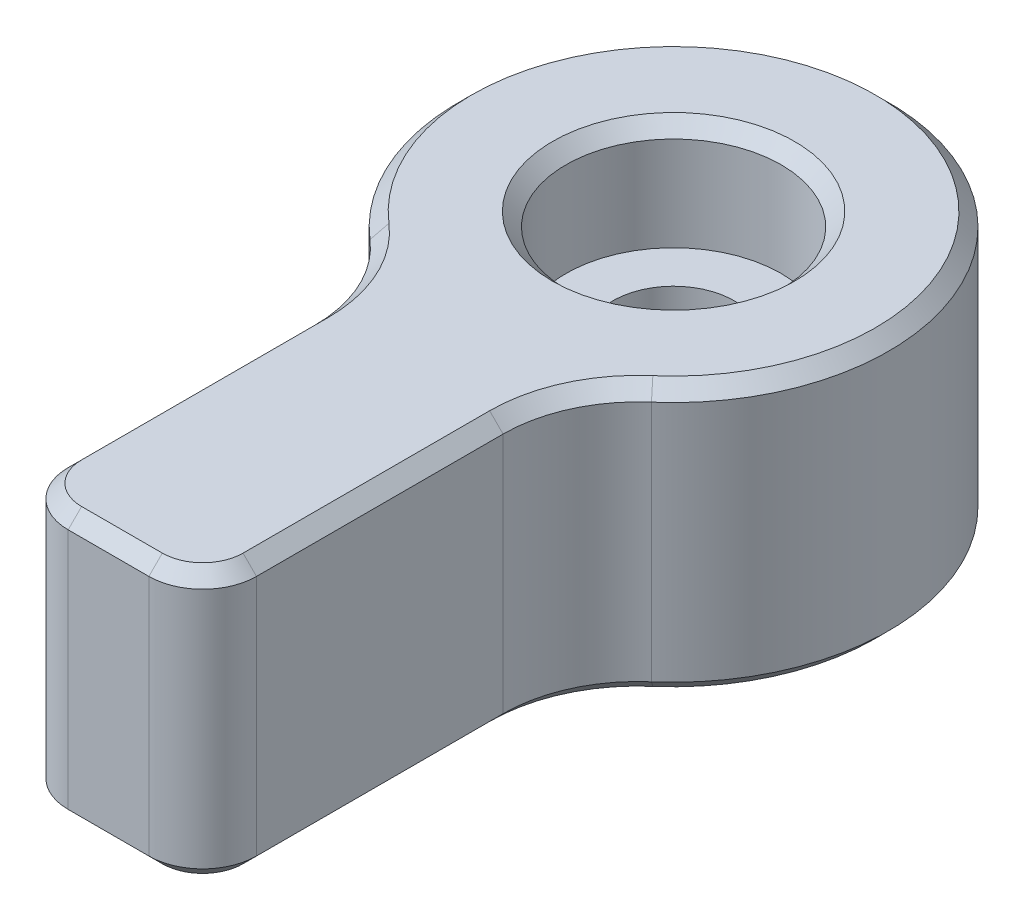
ISO-10303-21;
HEADER;
FILE_DESCRIPTION(('STEP AP214'),'2;1');
FILE_NAME('part.step','',(''),(''),'','','');
FILE_SCHEMA(('AUTOMOTIVE_DESIGN { 1 0 10303 214 1 1 1 1 }'));
ENDSEC;
DATA;
#1=APPLICATION_CONTEXT('core data for automotive mechanical design processes');
#2=APPLICATION_PROTOCOL_DEFINITION('international standard','automotive_design',2000,#1);
#3=PRODUCT_CONTEXT('',#1,'mechanical');
#4=PRODUCT('Part','Part','',(#3));
#5=PRODUCT_RELATED_PRODUCT_CATEGORY('part','',(#4));
#6=PRODUCT_DEFINITION_FORMATION('','',#4);
#7=PRODUCT_DEFINITION_CONTEXT('part definition',#1,'design');
#8=PRODUCT_DEFINITION('design','',#6,#7);
#9=PRODUCT_DEFINITION_SHAPE('','',#8);
#10=(LENGTH_UNIT() NAMED_UNIT(*) SI_UNIT(.MILLI.,.METRE.));
#11=(NAMED_UNIT(*) PLANE_ANGLE_UNIT() SI_UNIT($,.RADIAN.));
#12=(NAMED_UNIT(*) SI_UNIT($,.STERADIAN.) SOLID_ANGLE_UNIT());
#13=UNCERTAINTY_MEASURE_WITH_UNIT(LENGTH_MEASURE(1.E-05),#10,'distance_accuracy_value','');
#14=(GEOMETRIC_REPRESENTATION_CONTEXT(3) GLOBAL_UNCERTAINTY_ASSIGNED_CONTEXT((#13)) GLOBAL_UNIT_ASSIGNED_CONTEXT((#10,
#11,#12)) REPRESENTATION_CONTEXT('',''));
#15=CARTESIAN_POINT('',(0.,0.,0.));
#16=DIRECTION('',(0.,0.,1.));
#17=DIRECTION('',(1.,0.,0.));
#18=AXIS2_PLACEMENT_3D('',#15,#16,#17);
#19=CARTESIAN_POINT('',(3.5,10.,7.19374728496908));
#20=DIRECTION('',(-1.,0.,0.));
#21=DIRECTION('',(0.,0.,1.));
#22=AXIS2_PLACEMENT_3D('',#19,#20,#21);
#23=PLANE('',#22);
#24=DIRECTION('',(0.,-1.,0.));
#25=VECTOR('',#24,1.);
#26=CARTESIAN_POINT('',(3.50000000000001,10.,19.));
#27=LINE('',#26,#25);
#28=CARTESIAN_POINT('',(3.50000000000001,9.5,19.));
#29=VERTEX_POINT('',#28);
#30=CARTESIAN_POINT('',(3.50000000000001,0.5,19.));
#31=VERTEX_POINT('',#30);
#32=EDGE_CURVE('E336',#29,#31,#27,.T.);
#33=ORIENTED_EDGE('',*,*,#32,.T.);
#34=DIRECTION('',(0.,0.,-1.));
#35=VECTOR('',#34,1.);
#36=CARTESIAN_POINT('',(3.5,0.5,7.19374728496908));
#37=LINE('',#36,#35);
#38=CARTESIAN_POINT('',(3.50000000000001,0.5,9.836157786453));
#39=VERTEX_POINT('',#38);
#40=EDGE_CURVE('E213',#31,#39,#37,.T.);
#41=ORIENTED_EDGE('',*,*,#40,.T.);
#42=DIRECTION('',(0.,1.,0.));
#43=VECTOR('',#42,1.);
#44=CARTESIAN_POINT('',(3.50000000000001,10.,9.836157786453));
#45=LINE('',#44,#43);
#46=CARTESIAN_POINT('',(3.50000000000001,9.5,9.836157786453));
#47=VERTEX_POINT('',#46);
#48=EDGE_CURVE('E289',#39,#47,#45,.T.);
#49=ORIENTED_EDGE('',*,*,#48,.T.);
#50=DIRECTION('',(0.,0.,1.));
#51=VECTOR('',#50,1.);
#52=CARTESIAN_POINT('',(3.50000000000001,9.5,19.));
#53=LINE('',#52,#51);
#54=EDGE_CURVE('E211',#47,#29,#53,.T.);
#55=ORIENTED_EDGE('',*,*,#54,.T.);
#56=EDGE_LOOP('',(#33,#41,#49,#55));
#57=FACE_BOUND('',#56,.T.);
#58=ADVANCED_FACE('F36',(#57),#23,.F.);
#59=CARTESIAN_POINT('',(0.,10.,0.));
#60=DIRECTION('',(0.,-1.,0.));
#61=DIRECTION('',(0.,0.,-1.));
#62=AXIS2_PLACEMENT_3D('',#59,#60,#61);
#63=CYLINDRICAL_SURFACE('',#62,8.);
#64=DIRECTION('',(0.,-1.,0.));
#65=VECTOR('',#64,1.);
#66=CARTESIAN_POINT('',(5.23076923076923,10.,6.05302017627876));
#67=LINE('',#66,#65);
#68=CARTESIAN_POINT('',(5.23076923076923,9.5,6.05302017627876));
#69=VERTEX_POINT('',#68);
#70=CARTESIAN_POINT('',(5.23076923076923,0.5,6.05302017627876));
#71=VERTEX_POINT('',#70);
#72=EDGE_CURVE('E291',#69,#71,#67,.T.);
#73=ORIENTED_EDGE('',*,*,#72,.T.);
#74=CARTESIAN_POINT('',(0.,0.5,0.));
#75=DIRECTION('',(0.,1.,0.));
#76=DIRECTION('',(0.,0.,1.));
#77=AXIS2_PLACEMENT_3D('',#74,#75,#76);
#78=CIRCLE('',#77,8.);
#79=CARTESIAN_POINT('',(-5.23076923076923,0.5,6.05302017627877));
#80=VERTEX_POINT('',#79);
#81=EDGE_CURVE('E188',#71,#80,#78,.T.);
#82=ORIENTED_EDGE('',*,*,#81,.T.);
#83=DIRECTION('',(0.,-1.,0.));
#84=VECTOR('',#83,1.);
#85=CARTESIAN_POINT('',(-5.23076923076923,10.,6.05302017627877));
#86=LINE('',#85,#84);
#87=CARTESIAN_POINT('',(-5.23076923076923,9.5,6.05302017627877));
#88=VERTEX_POINT('',#87);
#89=EDGE_CURVE('E299',#80,#88,#86,.F.);
#90=ORIENTED_EDGE('',*,*,#89,.T.);
#91=CARTESIAN_POINT('',(0.,9.5,0.));
#92=DIRECTION('',(0.,1.,0.));
#93=DIRECTION('',(0.,0.,1.));
#94=AXIS2_PLACEMENT_3D('',#91,#92,#93);
#95=CIRCLE('',#94,8.);
#96=EDGE_CURVE('E186',#88,#69,#95,.F.);
#97=ORIENTED_EDGE('',*,*,#96,.T.);
#98=EDGE_LOOP('',(#73,#82,#90,#97));
#99=FACE_BOUND('',#98,.T.);
#100=ADVANCED_FACE('F324',(#99),#63,.T.);
#101=CARTESIAN_POINT('',(-3.49999999999999,10.,7.19374728496908));
#102=DIRECTION('',(1.,0.,0.));
#103=DIRECTION('',(0.,0.,-1.));
#104=AXIS2_PLACEMENT_3D('',#101,#102,#103);
#105=PLANE('',#104);
#106=DIRECTION('',(0.,1.,0.));
#107=VECTOR('',#106,1.);
#108=CARTESIAN_POINT('',(-3.49999999999999,0.,9.836157786453));
#109=LINE('',#108,#107);
#110=CARTESIAN_POINT('',(-3.49999999999999,9.5,9.836157786453));
#111=VERTEX_POINT('',#110);
#112=CARTESIAN_POINT('',(-3.49999999999999,0.5,9.836157786453));
#113=VERTEX_POINT('',#112);
#114=EDGE_CURVE('E295',#111,#113,#109,.F.);
#115=ORIENTED_EDGE('',*,*,#114,.T.);
#116=DIRECTION('',(0.,0.,1.));
#117=VECTOR('',#116,1.);
#118=CARTESIAN_POINT('',(-3.49999999999999,0.5,7.19374728496908));
#119=LINE('',#118,#117);
#120=CARTESIAN_POINT('',(-3.49999999999999,0.5,19.));
#121=VERTEX_POINT('',#120);
#122=EDGE_CURVE('E196',#113,#121,#119,.T.);
#123=ORIENTED_EDGE('',*,*,#122,.T.);
#124=DIRECTION('',(0.,-1.,0.));
#125=VECTOR('',#124,1.);
#126=CARTESIAN_POINT('',(-3.49999999999999,10.,19.));
#127=LINE('',#126,#125);
#128=CARTESIAN_POINT('',(-3.49999999999999,9.5,19.));
#129=VERTEX_POINT('',#128);
#130=EDGE_CURVE('E326',#121,#129,#127,.F.);
#131=ORIENTED_EDGE('',*,*,#130,.T.);
#132=DIRECTION('',(0.,0.,-1.));
#133=VECTOR('',#132,1.);
#134=CARTESIAN_POINT('',(-3.49999999999999,9.5,9.836157786453));
#135=LINE('',#134,#133);
#136=EDGE_CURVE('E194',#129,#111,#135,.T.);
#137=ORIENTED_EDGE('',*,*,#136,.T.);
#138=EDGE_LOOP('',(#115,#123,#131,#137));
#139=FACE_BOUND('',#138,.T.);
#140=ADVANCED_FACE('F366',(#139),#105,.F.);
#141=CARTESIAN_POINT('',(-3.49999999999999,10.,21.));
#142=DIRECTION('',(0.,0.,-1.));
#143=DIRECTION('',(-1.,0.,0.));
#144=AXIS2_PLACEMENT_3D('',#141,#142,#143);
#145=PLANE('',#144);
#146=DIRECTION('',(0.,-1.,0.));
#147=VECTOR('',#146,1.);
#148=CARTESIAN_POINT('',(-1.49999999999999,10.,21.));
#149=LINE('',#148,#147);
#150=CARTESIAN_POINT('',(-1.49999999999999,9.5,21.));
#151=VERTEX_POINT('',#150);
#152=CARTESIAN_POINT('',(-1.49999999999999,0.5,21.));
#153=VERTEX_POINT('',#152);
#154=EDGE_CURVE('E333',#151,#153,#149,.T.);
#155=ORIENTED_EDGE('',*,*,#154,.T.);
#156=DIRECTION('',(1.,0.,0.));
#157=VECTOR('',#156,1.);
#158=CARTESIAN_POINT('',(-3.49999999999999,0.5,21.));
#159=LINE('',#158,#157);
#160=CARTESIAN_POINT('',(1.50000000000001,0.5,21.));
#161=VERTEX_POINT('',#160);
#162=EDGE_CURVE('E205',#153,#161,#159,.T.);
#163=ORIENTED_EDGE('',*,*,#162,.T.);
#164=DIRECTION('',(0.,-1.,0.));
#165=VECTOR('',#164,1.);
#166=CARTESIAN_POINT('',(1.50000000000001,10.,21.));
#167=LINE('',#166,#165);
#168=CARTESIAN_POINT('',(1.50000000000001,9.5,21.));
#169=VERTEX_POINT('',#168);
#170=EDGE_CURVE('E328',#161,#169,#167,.F.);
#171=ORIENTED_EDGE('',*,*,#170,.T.);
#172=DIRECTION('',(-1.,0.,0.));
#173=VECTOR('',#172,1.);
#174=CARTESIAN_POINT('',(-1.49999999999999,9.5,21.));
#175=LINE('',#174,#173);
#176=EDGE_CURVE('E203',#169,#151,#175,.T.);
#177=ORIENTED_EDGE('',*,*,#176,.T.);
#178=EDGE_LOOP('',(#155,#163,#171,#177));
#179=FACE_BOUND('',#178,.T.);
#180=ADVANCED_FACE('F584',(#179),#145,.F.);
#181=CARTESIAN_POINT('',(0.,10.,0.));
#182=DIRECTION('',(0.,1.,0.));
#183=DIRECTION('',(0.,0.,1.));
#184=AXIS2_PLACEMENT_3D('',#181,#182,#183);
#185=PLANE('',#184);
#186=DIRECTION('',(0.,0.,1.));
#187=VECTOR('',#186,1.);
#188=CARTESIAN_POINT('',(-3.,10.,19.));
#189=LINE('',#188,#187);
#190=CARTESIAN_POINT('',(-3.,10.,9.836157786453));
#191=VERTEX_POINT('',#190);
#192=CARTESIAN_POINT('',(-3.,10.,19.));
#193=VERTEX_POINT('',#192);
#194=EDGE_CURVE('E53',#191,#193,#189,.T.);
#195=ORIENTED_EDGE('',*,*,#194,.T.);
#196=CARTESIAN_POINT('',(-1.49999999999999,10.,19.));
#197=DIRECTION('',(0.,1.,0.));
#198=DIRECTION('',(0.,0.,1.));
#199=AXIS2_PLACEMENT_3D('',#196,#197,#198);
#200=CIRCLE('',#199,1.50000000000001);
#201=CARTESIAN_POINT('',(-1.49999999999999,10.,20.5));
#202=VERTEX_POINT('',#201);
#203=EDGE_CURVE('E45',#193,#202,#200,.T.);
#204=ORIENTED_EDGE('',*,*,#203,.T.);
#205=DIRECTION('',(1.,0.,0.));
#206=VECTOR('',#205,1.);
#207=CARTESIAN_POINT('',(1.50000000000001,10.,20.5));
#208=LINE('',#207,#206);
#209=CARTESIAN_POINT('',(1.50000000000001,10.,20.5));
#210=VERTEX_POINT('',#209);
#211=EDGE_CURVE('E221',#202,#210,#208,.T.);
#212=ORIENTED_EDGE('',*,*,#211,.T.);
#213=CARTESIAN_POINT('',(1.50000000000001,10.,19.));
#214=DIRECTION('',(0.,1.,0.));
#215=DIRECTION('',(0.,0.,1.));
#216=AXIS2_PLACEMENT_3D('',#213,#214,#215);
#217=CIRCLE('',#216,1.50000000000001);
#218=CARTESIAN_POINT('',(3.00000000000001,10.,19.));
#219=VERTEX_POINT('',#218);
#220=EDGE_CURVE('E223',#210,#219,#217,.T.);
#221=ORIENTED_EDGE('',*,*,#220,.T.);
#222=DIRECTION('',(0.,0.,-1.));
#223=VECTOR('',#222,1.);
#224=CARTESIAN_POINT('',(3.00000000000001,10.,9.836157786453));
#225=LINE('',#224,#223);
#226=CARTESIAN_POINT('',(3.00000000000001,10.,9.836157786453));
#227=VERTEX_POINT('',#226);
#228=EDGE_CURVE('E225',#219,#227,#225,.T.);
#229=ORIENTED_EDGE('',*,*,#228,.T.);
#230=CARTESIAN_POINT('',(8.50000000000001,10.,9.83615778645299));
#231=DIRECTION('',(0.,1.,0.));
#232=DIRECTION('',(0.,0.,1.));
#233=AXIS2_PLACEMENT_3D('',#230,#231,#232);
#234=CIRCLE('',#233,5.49999999999999);
#235=CARTESIAN_POINT('',(4.90384615384616,10.,5.67470641526134));
#236=VERTEX_POINT('',#235);
#237=EDGE_CURVE('E227',#227,#236,#234,.F.);
#238=ORIENTED_EDGE('',*,*,#237,.T.);
#239=CARTESIAN_POINT('',(0.,10.,0.));
#240=DIRECTION('',(0.,1.,0.));
#241=DIRECTION('',(0.,0.,1.));
#242=AXIS2_PLACEMENT_3D('',#239,#240,#241);
#243=CIRCLE('',#242,7.50000000000001);
#244=CARTESIAN_POINT('',(-4.90384615384615,10.,5.67470641526135));
#245=VERTEX_POINT('',#244);
#246=EDGE_CURVE('E229',#236,#245,#243,.T.);
#247=ORIENTED_EDGE('',*,*,#246,.T.);
#248=CARTESIAN_POINT('',(-8.49999999999999,10.,9.836157786453));
#249=DIRECTION('',(0.,1.,0.));
#250=DIRECTION('',(0.,0.,1.));
#251=AXIS2_PLACEMENT_3D('',#248,#249,#250);
#252=CIRCLE('',#251,5.49999999999999);
#253=EDGE_CURVE('E58',#245,#191,#252,.F.);
#254=ORIENTED_EDGE('',*,*,#253,.T.);
#255=EDGE_LOOP('',(#195,#204,#212,#221,#229,#238,#247,#254));
#256=FACE_BOUND('',#255,.T.);
#257=CARTESIAN_POINT('',(0.,10.,0.));
#258=DIRECTION('',(0.,1.,0.));
#259=DIRECTION('',(0.,0.,1.));
#260=AXIS2_PLACEMENT_3D('',#257,#258,#259);
#261=CIRCLE('',#260,4.49999999999999);
#262=CARTESIAN_POINT('',(0.,10.,4.49999999999999));
#263=VERTEX_POINT('',#262);
#264=EDGE_CURVE('E218',#263,#263,#261,.F.);
#265=ORIENTED_EDGE('',*,*,#264,.T.);
#266=EDGE_LOOP('',(#265));
#267=FACE_BOUND('',#266,.T.);
#268=ADVANCED_FACE('F576',(#256,#267),#185,.T.);
#269=CARTESIAN_POINT('',(0.,0.,0.));
#270=DIRECTION('',(0.,1.,0.));
#271=DIRECTION('',(0.,0.,1.));
#272=AXIS2_PLACEMENT_3D('',#269,#270,#271);
#273=PLANE('',#272);
#274=CARTESIAN_POINT('',(0.,0.,0.));
#275=DIRECTION('',(0.,1.,0.));
#276=DIRECTION('',(0.,0.,1.));
#277=AXIS2_PLACEMENT_3D('',#274,#275,#276);
#278=CIRCLE('',#277,7.49999999999999);
#279=CARTESIAN_POINT('',(-4.90384615384615,0.,5.67470641526134));
#280=VERTEX_POINT('',#279);
#281=CARTESIAN_POINT('',(4.90384615384616,0.,5.67470641526134));
#282=VERTEX_POINT('',#281);
#283=EDGE_CURVE('E176',#280,#282,#278,.F.);
#284=ORIENTED_EDGE('',*,*,#283,.T.);
#285=CARTESIAN_POINT('',(8.50000000000001,0.,9.83615778645299));
#286=DIRECTION('',(0.,1.,0.));
#287=DIRECTION('',(0.,0.,1.));
#288=AXIS2_PLACEMENT_3D('',#285,#286,#287);
#289=CIRCLE('',#288,5.50000000000001);
#290=CARTESIAN_POINT('',(3.,0.,9.836157786453));
#291=VERTEX_POINT('',#290);
#292=EDGE_CURVE('E156',#282,#291,#289,.T.);
#293=ORIENTED_EDGE('',*,*,#292,.T.);
#294=DIRECTION('',(0.,0.,1.));
#295=VECTOR('',#294,1.);
#296=CARTESIAN_POINT('',(3.,0.,0.));
#297=LINE('',#296,#295);
#298=CARTESIAN_POINT('',(3.,0.,19.));
#299=VERTEX_POINT('',#298);
#300=EDGE_CURVE('E164',#291,#299,#297,.T.);
#301=ORIENTED_EDGE('',*,*,#300,.T.);
#302=CARTESIAN_POINT('',(1.50000000000001,0.,19.));
#303=DIRECTION('',(0.,1.,0.));
#304=DIRECTION('',(0.,0.,1.));
#305=AXIS2_PLACEMENT_3D('',#302,#303,#304);
#306=CIRCLE('',#305,1.49999999999999);
#307=CARTESIAN_POINT('',(1.50000000000001,0.,20.5));
#308=VERTEX_POINT('',#307);
#309=EDGE_CURVE('E170',#299,#308,#306,.F.);
#310=ORIENTED_EDGE('',*,*,#309,.T.);
#311=DIRECTION('',(-1.,0.,0.));
#312=VECTOR('',#311,1.);
#313=CARTESIAN_POINT('',(0.,0.,20.5));
#314=LINE('',#313,#312);
#315=CARTESIAN_POINT('',(-1.49999999999999,0.,20.5));
#316=VERTEX_POINT('',#315);
#317=EDGE_CURVE('E306',#308,#316,#314,.T.);
#318=ORIENTED_EDGE('',*,*,#317,.T.);
#319=CARTESIAN_POINT('',(-1.49999999999999,0.,19.));
#320=DIRECTION('',(0.,1.,0.));
#321=DIRECTION('',(0.,0.,1.));
#322=AXIS2_PLACEMENT_3D('',#319,#320,#321);
#323=CIRCLE('',#322,1.5);
#324=CARTESIAN_POINT('',(-2.99999999999999,0.,19.));
#325=VERTEX_POINT('',#324);
#326=EDGE_CURVE('E308',#316,#325,#323,.F.);
#327=ORIENTED_EDGE('',*,*,#326,.T.);
#328=DIRECTION('',(0.,0.,-1.));
#329=VECTOR('',#328,1.);
#330=CARTESIAN_POINT('',(-2.99999999999999,0.,0.));
#331=LINE('',#330,#329);
#332=CARTESIAN_POINT('',(-2.99999999999999,0.,9.836157786453));
#333=VERTEX_POINT('',#332);
#334=EDGE_CURVE('E310',#325,#333,#331,.T.);
#335=ORIENTED_EDGE('',*,*,#334,.T.);
#336=CARTESIAN_POINT('',(-8.49999999999999,0.,9.836157786453));
#337=DIRECTION('',(0.,1.,0.));
#338=DIRECTION('',(0.,0.,1.));
#339=AXIS2_PLACEMENT_3D('',#336,#337,#338);
#340=CIRCLE('',#339,5.5);
#341=EDGE_CURVE('E181',#333,#280,#340,.T.);
#342=ORIENTED_EDGE('',*,*,#341,.T.);
#343=EDGE_LOOP('',(#284,#293,#301,#310,#318,#327,#335,#342));
#344=FACE_BOUND('',#343,.T.);
#345=CARTESIAN_POINT('',(0.,0.,0.));
#346=DIRECTION('',(0.,1.,0.));
#347=DIRECTION('',(0.,0.,1.));
#348=AXIS2_PLACEMENT_3D('',#345,#346,#347);
#349=CIRCLE('',#348,2.75);
#350=CARTESIAN_POINT('',(0.,0.,2.75));
#351=VERTEX_POINT('',#350);
#352=EDGE_CURVE('E171',#351,#351,#349,.T.);
#353=ORIENTED_EDGE('',*,*,#352,.T.);
#354=EDGE_LOOP('',(#353));
#355=FACE_BOUND('',#354,.T.);
#356=ADVANCED_FACE('F173',(#344,#355),#273,.F.);
#357=CARTESIAN_POINT('',(0.,10.,0.));
#358=DIRECTION('',(0.,1.,0.));
#359=DIRECTION('',(0.,0.,1.));
#360=AXIS2_PLACEMENT_3D('',#357,#358,#359);
#361=CYLINDRICAL_SURFACE('',#360,2.25);
#362=CARTESIAN_POINT('',(0.,0.499999999999999,0.));
#363=DIRECTION('',(0.,1.,0.));
#364=DIRECTION('',(0.,0.,1.));
#365=AXIS2_PLACEMENT_3D('',#362,#363,#364);
#366=CIRCLE('',#365,2.25);
#367=CARTESIAN_POINT('',(0.,0.499999999999999,2.25));
#368=VERTEX_POINT('',#367);
#369=EDGE_CURVE('E215',#368,#368,#366,.F.);
#370=ORIENTED_EDGE('',*,*,#369,.T.);
#371=EDGE_LOOP('',(#370));
#372=FACE_BOUND('',#371,.T.);
#373=CARTESIAN_POINT('',(0.,6.,0.));
#374=DIRECTION('',(0.,1.,0.));
#375=DIRECTION('',(0.,0.,1.));
#376=AXIS2_PLACEMENT_3D('',#373,#374,#375);
#377=CIRCLE('',#376,2.25);
#378=CARTESIAN_POINT('',(0.,6.,2.25));
#379=VERTEX_POINT('',#378);
#380=EDGE_CURVE('E338',#379,#379,#377,.T.);
#381=ORIENTED_EDGE('',*,*,#380,.T.);
#382=EDGE_LOOP('',(#381));
#383=FACE_BOUND('',#382,.T.);
#384=ADVANCED_FACE('F358',(#372,#383),#361,.F.);
#385=CARTESIAN_POINT('',(2.25,6.,0.));
#386=DIRECTION('',(0.,-1.,0.));
#387=DIRECTION('',(0.,0.,-1.));
#388=AXIS2_PLACEMENT_3D('',#385,#386,#387);
#389=PLANE('',#388);
#390=ORIENTED_EDGE('',*,*,#380,.F.);
#391=EDGE_LOOP('',(#390));
#392=FACE_BOUND('',#391,.T.);
#393=CARTESIAN_POINT('',(0.,6.,0.));
#394=DIRECTION('',(0.,1.,0.));
#395=DIRECTION('',(0.,0.,1.));
#396=AXIS2_PLACEMENT_3D('',#393,#394,#395);
#397=CIRCLE('',#396,4.);
#398=CARTESIAN_POINT('',(0.,6.,4.));
#399=VERTEX_POINT('',#398);
#400=EDGE_CURVE('E251',#399,#399,#397,.T.);
#401=ORIENTED_EDGE('',*,*,#400,.T.);
#402=EDGE_LOOP('',(#401));
#403=FACE_BOUND('',#402,.T.);
#404=ADVANCED_FACE('F344',(#392,#403),#389,.F.);
#405=CARTESIAN_POINT('',(0.,10.,0.));
#406=DIRECTION('',(0.,1.,0.));
#407=DIRECTION('',(0.,0.,1.));
#408=AXIS2_PLACEMENT_3D('',#405,#406,#407);
#409=CYLINDRICAL_SURFACE('',#408,3.99999999999999);
#410=CARTESIAN_POINT('',(0.,9.50000000000001,0.));
#411=DIRECTION('',(0.,1.,0.));
#412=DIRECTION('',(0.,0.,1.));
#413=AXIS2_PLACEMENT_3D('',#410,#411,#412);
#414=CIRCLE('',#413,3.99999999999999);
#415=CARTESIAN_POINT('',(0.,9.50000000000001,3.99999999999999));
#416=VERTEX_POINT('',#415);
#417=EDGE_CURVE('E11',#416,#416,#414,.T.);
#418=ORIENTED_EDGE('',*,*,#417,.T.);
#419=EDGE_LOOP('',(#418));
#420=FACE_BOUND('',#419,.T.);
#421=ORIENTED_EDGE('',*,*,#400,.F.);
#422=EDGE_LOOP('',(#421));
#423=FACE_BOUND('',#422,.T.);
#424=ADVANCED_FACE('F346',(#420,#423),#409,.F.);
#425=CARTESIAN_POINT('',(1.50000000000001,10.,19.));
#426=DIRECTION('',(0.,-1.,0.));
#427=DIRECTION('',(0.,0.,-1.));
#428=AXIS2_PLACEMENT_3D('',#425,#426,#427);
#429=CYLINDRICAL_SURFACE('',#428,2.);
#430=ORIENTED_EDGE('',*,*,#170,.F.);
#431=CARTESIAN_POINT('',(1.50000000000001,0.5,19.));
#432=DIRECTION('',(0.,1.,0.));
#433=DIRECTION('',(0.,0.,1.));
#434=AXIS2_PLACEMENT_3D('',#431,#432,#433);
#435=CIRCLE('',#434,2.);
#436=EDGE_CURVE('E209',#161,#31,#435,.T.);
#437=ORIENTED_EDGE('',*,*,#436,.T.);
#438=ORIENTED_EDGE('',*,*,#32,.F.);
#439=CARTESIAN_POINT('',(1.50000000000001,9.5,19.));
#440=DIRECTION('',(0.,1.,0.));
#441=DIRECTION('',(0.,0.,1.));
#442=AXIS2_PLACEMENT_3D('',#439,#440,#441);
#443=CIRCLE('',#442,2.);
#444=EDGE_CURVE('E207',#29,#169,#443,.F.);
#445=ORIENTED_EDGE('',*,*,#444,.T.);
#446=EDGE_LOOP('',(#430,#437,#438,#445));
#447=FACE_BOUND('',#446,.T.);
#448=ADVANCED_FACE('F348',(#447),#429,.T.);
#449=CARTESIAN_POINT('',(-1.49999999999999,10.,19.));
#450=DIRECTION('',(0.,-1.,0.));
#451=DIRECTION('',(0.,0.,-1.));
#452=AXIS2_PLACEMENT_3D('',#449,#450,#451);
#453=CYLINDRICAL_SURFACE('',#452,2.);
#454=ORIENTED_EDGE('',*,*,#130,.F.);
#455=CARTESIAN_POINT('',(-1.49999999999999,0.5,19.));
#456=DIRECTION('',(0.,1.,0.));
#457=DIRECTION('',(0.,0.,1.));
#458=AXIS2_PLACEMENT_3D('',#455,#456,#457);
#459=CIRCLE('',#458,2.);
#460=EDGE_CURVE('E201',#121,#153,#459,.T.);
#461=ORIENTED_EDGE('',*,*,#460,.T.);
#462=ORIENTED_EDGE('',*,*,#154,.F.);
#463=CARTESIAN_POINT('',(-1.49999999999999,9.5,19.));
#464=DIRECTION('',(0.,1.,0.));
#465=DIRECTION('',(0.,0.,1.));
#466=AXIS2_PLACEMENT_3D('',#463,#464,#465);
#467=CIRCLE('',#466,2.);
#468=EDGE_CURVE('E198',#151,#129,#467,.F.);
#469=ORIENTED_EDGE('',*,*,#468,.T.);
#470=EDGE_LOOP('',(#454,#461,#462,#469));
#471=FACE_BOUND('',#470,.T.);
#472=ADVANCED_FACE('F355',(#471),#453,.T.);
#473=CARTESIAN_POINT('',(8.50000000000001,10.,9.83615778645299));
#474=DIRECTION('',(0.,-1.,0.));
#475=DIRECTION('',(0.,0.,-1.));
#476=AXIS2_PLACEMENT_3D('',#473,#474,#475);
#477=CYLINDRICAL_SURFACE('',#476,5.);
#478=ORIENTED_EDGE('',*,*,#48,.F.);
#479=CARTESIAN_POINT('',(8.50000000000001,0.5,9.83615778645299));
#480=DIRECTION('',(0.,1.,0.));
#481=DIRECTION('',(0.,0.,1.));
#482=AXIS2_PLACEMENT_3D('',#479,#480,#481);
#483=CIRCLE('',#482,5.);
#484=EDGE_CURVE('E158',#39,#71,#483,.F.);
#485=ORIENTED_EDGE('',*,*,#484,.T.);
#486=ORIENTED_EDGE('',*,*,#72,.F.);
#487=CARTESIAN_POINT('',(8.50000000000001,9.5,9.83615778645299));
#488=DIRECTION('',(0.,1.,0.));
#489=DIRECTION('',(0.,0.,1.));
#490=AXIS2_PLACEMENT_3D('',#487,#488,#489);
#491=CIRCLE('',#490,5.);
#492=EDGE_CURVE('E178',#69,#47,#491,.T.);
#493=ORIENTED_EDGE('',*,*,#492,.T.);
#494=EDGE_LOOP('',(#478,#485,#486,#493));
#495=FACE_BOUND('',#494,.T.);
#496=ADVANCED_FACE('F288',(#495),#477,.F.);
#497=CARTESIAN_POINT('',(-8.49999999999999,10.,9.836157786453));
#498=DIRECTION('',(0.,-1.,0.));
#499=DIRECTION('',(0.,0.,-1.));
#500=AXIS2_PLACEMENT_3D('',#497,#498,#499);
#501=CYLINDRICAL_SURFACE('',#500,5.);
#502=ORIENTED_EDGE('',*,*,#89,.F.);
#503=CARTESIAN_POINT('',(-8.49999999999999,0.5,9.836157786453));
#504=DIRECTION('',(0.,1.,0.));
#505=DIRECTION('',(0.,0.,1.));
#506=AXIS2_PLACEMENT_3D('',#503,#504,#505);
#507=CIRCLE('',#506,5.);
#508=EDGE_CURVE('E192',#80,#113,#507,.F.);
#509=ORIENTED_EDGE('',*,*,#508,.T.);
#510=ORIENTED_EDGE('',*,*,#114,.F.);
#511=CARTESIAN_POINT('',(-8.49999999999999,9.5,9.836157786453));
#512=DIRECTION('',(0.,1.,0.));
#513=DIRECTION('',(0.,0.,1.));
#514=AXIS2_PLACEMENT_3D('',#511,#512,#513);
#515=CIRCLE('',#514,5.);
#516=EDGE_CURVE('E190',#111,#88,#515,.T.);
#517=ORIENTED_EDGE('',*,*,#516,.T.);
#518=EDGE_LOOP('',(#502,#509,#510,#517));
#519=FACE_BOUND('',#518,.T.);
#520=ADVANCED_FACE('F375',(#519),#501,.F.);
#521=CARTESIAN_POINT('',(-1.49999999999999,0.,19.));
#522=DIRECTION('',(0.,1.,0.));
#523=DIRECTION('',(0.,0.,1.));
#524=AXIS2_PLACEMENT_3D('',#521,#522,#523);
#525=CONICAL_SURFACE('',#524,1.5,0.785398163397452);
#526=DIRECTION('',(0.,-0.707106781186545,-0.70710678118655));
#527=VECTOR('',#526,1.);
#528=CARTESIAN_POINT('',(-1.49999999999999,0.5,21.));
#529=LINE('',#528,#527);
#530=EDGE_CURVE('E245',#153,#316,#529,.T.);
#531=ORIENTED_EDGE('',*,*,#530,.F.);
#532=ORIENTED_EDGE('',*,*,#460,.F.);
#533=DIRECTION('',(-0.70710678118655,0.707106781186545,0.));
#534=VECTOR('',#533,1.);
#535=CARTESIAN_POINT('',(-2.99999999999999,0.,19.));
#536=LINE('',#535,#534);
#537=EDGE_CURVE('E248',#325,#121,#536,.T.);
#538=ORIENTED_EDGE('',*,*,#537,.F.);
#539=ORIENTED_EDGE('',*,*,#326,.F.);
#540=EDGE_LOOP('',(#531,#532,#538,#539));
#541=FACE_BOUND('',#540,.T.);
#542=ADVANCED_FACE('F378',(#541),#525,.T.);
#543=CARTESIAN_POINT('',(-3.49999999999999,0.5,7.19374728496908));
#544=DIRECTION('',(0.707106781186545,0.70710678118655,0.));
#545=DIRECTION('',(0.,0.,1.));
#546=AXIS2_PLACEMENT_3D('',#543,#544,#545);
#547=PLANE('',#546);
#548=ORIENTED_EDGE('',*,*,#537,.T.);
#549=ORIENTED_EDGE('',*,*,#122,.F.);
#550=DIRECTION('',(-0.70710678118655,0.707106781186545,0.));
#551=VECTOR('',#550,1.);
#552=CARTESIAN_POINT('',(-2.99999999999999,0.,9.836157786453));
#553=LINE('',#552,#551);
#554=EDGE_CURVE('E242',#333,#113,#553,.T.);
#555=ORIENTED_EDGE('',*,*,#554,.F.);
#556=ORIENTED_EDGE('',*,*,#334,.F.);
#557=EDGE_LOOP('',(#548,#549,#555,#556));
#558=FACE_BOUND('',#557,.T.);
#559=ADVANCED_FACE('F395',(#558),#547,.F.);
#560=CARTESIAN_POINT('',(-3.49999999999999,0.5,21.));
#561=DIRECTION('',(0.,0.70710678118655,-0.707106781186545));
#562=DIRECTION('',(1.,0.,0.));
#563=AXIS2_PLACEMENT_3D('',#560,#561,#562);
#564=PLANE('',#563);
#565=ORIENTED_EDGE('',*,*,#530,.T.);
#566=ORIENTED_EDGE('',*,*,#317,.F.);
#567=DIRECTION('',(0.,-0.707106781186545,-0.70710678118655));
#568=VECTOR('',#567,1.);
#569=CARTESIAN_POINT('',(1.50000000000001,0.5,21.));
#570=LINE('',#569,#568);
#571=EDGE_CURVE('E239',#161,#308,#570,.T.);
#572=ORIENTED_EDGE('',*,*,#571,.F.);
#573=ORIENTED_EDGE('',*,*,#162,.F.);
#574=EDGE_LOOP('',(#565,#566,#572,#573));
#575=FACE_BOUND('',#574,.T.);
#576=ADVANCED_FACE('F392',(#575),#564,.F.);
#577=CARTESIAN_POINT('',(-8.49999999999999,0.,9.836157786453));
#578=DIRECTION('',(0.,-1.,0.));
#579=DIRECTION('',(0.,0.,-1.));
#580=AXIS2_PLACEMENT_3D('',#577,#578,#579);
#581=CONICAL_SURFACE('',#580,5.5,0.785398163397452);
#582=ORIENTED_EDGE('',*,*,#554,.T.);
#583=ORIENTED_EDGE('',*,*,#508,.F.);
#584=DIRECTION('',(-0.46233904923736,0.707106781186545,0.535016451663215));
#585=VECTOR('',#584,1.);
#586=CARTESIAN_POINT('',(-4.90384615384615,0.,5.67470641526134));
#587=LINE('',#586,#585);
#588=EDGE_CURVE('E236',#280,#80,#587,.T.);
#589=ORIENTED_EDGE('',*,*,#588,.F.);
#590=ORIENTED_EDGE('',*,*,#341,.F.);
#591=EDGE_LOOP('',(#582,#583,#589,#590));
#592=FACE_BOUND('',#591,.T.);
#593=ADVANCED_FACE('F317',(#592),#581,.F.);
#594=CARTESIAN_POINT('',(1.50000000000001,0.,19.));
#595=DIRECTION('',(0.,1.,0.));
#596=DIRECTION('',(0.,0.,1.));
#597=AXIS2_PLACEMENT_3D('',#594,#595,#596);
#598=CONICAL_SURFACE('',#597,1.49999999999999,0.785398163397454);
#599=ORIENTED_EDGE('',*,*,#571,.T.);
#600=ORIENTED_EDGE('',*,*,#309,.F.);
#601=DIRECTION('',(-0.707106781186551,-0.707106781186544,0.));
#602=VECTOR('',#601,1.);
#603=CARTESIAN_POINT('',(3.50000000000001,0.5,19.));
#604=LINE('',#603,#602);
#605=EDGE_CURVE('E167',#31,#299,#604,.T.);
#606=ORIENTED_EDGE('',*,*,#605,.F.);
#607=ORIENTED_EDGE('',*,*,#436,.F.);
#608=EDGE_LOOP('',(#599,#600,#606,#607));
#609=FACE_BOUND('',#608,.T.);
#610=ADVANCED_FACE('F386',(#609),#598,.T.);
#611=CARTESIAN_POINT('',(0.,0.5,0.));
#612=DIRECTION('',(0.,1.,0.));
#613=DIRECTION('',(0.,0.,1.));
#614=AXIS2_PLACEMENT_3D('',#611,#612,#613);
#615=CONICAL_SURFACE('',#614,8.,0.785398163397452);
#616=ORIENTED_EDGE('',*,*,#588,.T.);
#617=ORIENTED_EDGE('',*,*,#81,.F.);
#618=DIRECTION('',(0.462339049237359,0.707106781186544,0.535016451663216));
#619=VECTOR('',#618,1.);
#620=CARTESIAN_POINT('',(4.90384615384616,0.,5.67470641526134));
#621=LINE('',#620,#619);
#622=EDGE_CURVE('E161',#282,#71,#621,.T.);
#623=ORIENTED_EDGE('',*,*,#622,.F.);
#624=ORIENTED_EDGE('',*,*,#283,.F.);
#625=EDGE_LOOP('',(#616,#617,#623,#624));
#626=FACE_BOUND('',#625,.T.);
#627=ADVANCED_FACE('F320',(#626),#615,.T.);
#628=CARTESIAN_POINT('',(3.5,0.5,7.19374728496908));
#629=DIRECTION('',(-0.707106781186545,0.70710678118655,0.));
#630=DIRECTION('',(0.,0.,-1.));
#631=AXIS2_PLACEMENT_3D('',#628,#629,#630);
#632=PLANE('',#631);
#633=ORIENTED_EDGE('',*,*,#605,.T.);
#634=ORIENTED_EDGE('',*,*,#300,.F.);
#635=DIRECTION('',(-0.70710678118655,-0.707106781186545,0.));
#636=VECTOR('',#635,1.);
#637=CARTESIAN_POINT('',(3.50000000000001,0.5,9.836157786453));
#638=LINE('',#637,#636);
#639=EDGE_CURVE('E152',#39,#291,#638,.T.);
#640=ORIENTED_EDGE('',*,*,#639,.F.);
#641=ORIENTED_EDGE('',*,*,#40,.F.);
#642=EDGE_LOOP('',(#633,#634,#640,#641));
#643=FACE_BOUND('',#642,.T.);
#644=ADVANCED_FACE('F165',(#643),#632,.F.);
#645=CARTESIAN_POINT('',(8.50000000000001,0.,9.83615778645299));
#646=DIRECTION('',(0.,-1.,0.));
#647=DIRECTION('',(0.,0.,-1.));
#648=AXIS2_PLACEMENT_3D('',#645,#646,#647);
#649=CONICAL_SURFACE('',#648,5.5,0.785398163397452);
#650=ORIENTED_EDGE('',*,*,#622,.T.);
#651=ORIENTED_EDGE('',*,*,#484,.F.);
#652=ORIENTED_EDGE('',*,*,#639,.T.);
#653=ORIENTED_EDGE('',*,*,#292,.F.);
#654=EDGE_LOOP('',(#650,#651,#652,#653));
#655=FACE_BOUND('',#654,.T.);
#656=ADVANCED_FACE('F154',(#655),#649,.F.);
#657=CARTESIAN_POINT('',(0.,0.,0.));
#658=DIRECTION('',(0.,-1.,0.));
#659=DIRECTION('',(0.,0.,-1.));
#660=AXIS2_PLACEMENT_3D('',#657,#658,#659);
#661=CONICAL_SURFACE('',#660,2.75,0.785398163397445);
#662=ORIENTED_EDGE('',*,*,#369,.F.);
#663=EDGE_LOOP('',(#662));
#664=FACE_BOUND('',#663,.T.);
#665=ORIENTED_EDGE('',*,*,#352,.F.);
#666=EDGE_LOOP('',(#665));
#667=FACE_BOUND('',#666,.T.);
#668=ADVANCED_FACE('F381',(#664,#667),#661,.F.);
#669=CARTESIAN_POINT('',(8.50000000000001,10.,9.83615778645299));
#670=DIRECTION('',(0.,1.,0.));
#671=DIRECTION('',(0.,0.,1.));
#672=AXIS2_PLACEMENT_3D('',#669,#670,#671);
#673=CONICAL_SURFACE('',#672,5.49999999999999,0.785398163397441);
#674=DIRECTION('',(-0.707106781186543,0.707106781186552,0.));
#675=VECTOR('',#674,1.);
#676=CARTESIAN_POINT('',(3.50000000000001,9.5,9.836157786453));
#677=LINE('',#676,#675);
#678=EDGE_CURVE('E267',#47,#227,#677,.T.);
#679=ORIENTED_EDGE('',*,*,#678,.F.);
#680=ORIENTED_EDGE('',*,*,#492,.F.);
#681=DIRECTION('',(0.462339049237355,-0.707106781186552,0.53501645166321));
#682=VECTOR('',#681,1.);
#683=CARTESIAN_POINT('',(4.90384615384616,10.,5.67470641526134));
#684=LINE('',#683,#682);
#685=EDGE_CURVE('E40',#236,#69,#684,.T.);
#686=ORIENTED_EDGE('',*,*,#685,.F.);
#687=ORIENTED_EDGE('',*,*,#237,.F.);
#688=EDGE_LOOP('',(#679,#680,#686,#687));
#689=FACE_BOUND('',#688,.T.);
#690=ADVANCED_FACE('F283',(#689),#673,.F.);
#691=CARTESIAN_POINT('',(0.,10.,0.));
#692=DIRECTION('',(0.,-1.,0.));
#693=DIRECTION('',(0.,0.,-1.));
#694=AXIS2_PLACEMENT_3D('',#691,#692,#693);
#695=CONICAL_SURFACE('',#694,7.50000000000001,0.785398163397441);
#696=ORIENTED_EDGE('',*,*,#685,.T.);
#697=ORIENTED_EDGE('',*,*,#96,.F.);
#698=DIRECTION('',(-0.462339049237355,-0.707106781186552,0.53501645166321));
#699=VECTOR('',#698,1.);
#700=CARTESIAN_POINT('',(-4.90384615384615,10.,5.67470641526135));
#701=LINE('',#700,#699);
#702=EDGE_CURVE('E265',#245,#88,#701,.T.);
#703=ORIENTED_EDGE('',*,*,#702,.F.);
#704=ORIENTED_EDGE('',*,*,#246,.F.);
#705=EDGE_LOOP('',(#696,#697,#703,#704));
#706=FACE_BOUND('',#705,.T.);
#707=ADVANCED_FACE('F278',(#706),#695,.T.);
#708=CARTESIAN_POINT('',(3.00000000000001,10.,0.));
#709=DIRECTION('',(0.707106781186552,0.707106781186543,0.));
#710=DIRECTION('',(0.,0.,1.));
#711=AXIS2_PLACEMENT_3D('',#708,#709,#710);
#712=PLANE('',#711);
#713=ORIENTED_EDGE('',*,*,#678,.T.);
#714=ORIENTED_EDGE('',*,*,#228,.F.);
#715=DIRECTION('',(-0.707106781186543,0.707106781186552,0.));
#716=VECTOR('',#715,1.);
#717=CARTESIAN_POINT('',(3.50000000000001,9.5,19.));
#718=LINE('',#717,#716);
#719=EDGE_CURVE('E262',#29,#219,#718,.T.);
#720=ORIENTED_EDGE('',*,*,#719,.F.);
#721=ORIENTED_EDGE('',*,*,#54,.F.);
#722=EDGE_LOOP('',(#713,#714,#720,#721));
#723=FACE_BOUND('',#722,.T.);
#724=ADVANCED_FACE('F425',(#723),#712,.T.);
#725=CARTESIAN_POINT('',(-8.49999999999999,10.,9.836157786453));
#726=DIRECTION('',(0.,1.,0.));
#727=DIRECTION('',(0.,0.,1.));
#728=AXIS2_PLACEMENT_3D('',#725,#726,#727);
#729=CONICAL_SURFACE('',#728,5.49999999999999,0.785398163397441);
#730=ORIENTED_EDGE('',*,*,#702,.T.);
#731=ORIENTED_EDGE('',*,*,#516,.F.);
#732=DIRECTION('',(-0.707106781186543,-0.707106781186552,0.));
#733=VECTOR('',#732,1.);
#734=CARTESIAN_POINT('',(-3.,10.,9.836157786453));
#735=LINE('',#734,#733);
#736=EDGE_CURVE('E259',#191,#111,#735,.T.);
#737=ORIENTED_EDGE('',*,*,#736,.F.);
#738=ORIENTED_EDGE('',*,*,#253,.F.);
#739=EDGE_LOOP('',(#730,#731,#737,#738));
#740=FACE_BOUND('',#739,.T.);
#741=ADVANCED_FACE('F421',(#740),#729,.F.);
#742=CARTESIAN_POINT('',(1.50000000000001,10.,19.));
#743=DIRECTION('',(0.,-1.,0.));
#744=DIRECTION('',(0.,0.,-1.));
#745=AXIS2_PLACEMENT_3D('',#742,#743,#744);
#746=CONICAL_SURFACE('',#745,1.5,0.785398163397443);
#747=ORIENTED_EDGE('',*,*,#719,.T.);
#748=ORIENTED_EDGE('',*,*,#220,.F.);
#749=DIRECTION('',(0.,0.707106781186552,-0.707106781186543));
#750=VECTOR('',#749,1.);
#751=CARTESIAN_POINT('',(1.50000000000001,9.5,21.));
#752=LINE('',#751,#750);
#753=EDGE_CURVE('E256',#169,#210,#752,.T.);
#754=ORIENTED_EDGE('',*,*,#753,.F.);
#755=ORIENTED_EDGE('',*,*,#444,.F.);
#756=EDGE_LOOP('',(#747,#748,#754,#755));
#757=FACE_BOUND('',#756,.T.);
#758=ADVANCED_FACE('F417',(#757),#746,.T.);
#759=CARTESIAN_POINT('',(-3.,10.,0.));
#760=DIRECTION('',(-0.707106781186552,0.707106781186543,0.));
#761=DIRECTION('',(0.,0.,-1.));
#762=AXIS2_PLACEMENT_3D('',#759,#760,#761);
#763=PLANE('',#762);
#764=ORIENTED_EDGE('',*,*,#736,.T.);
#765=ORIENTED_EDGE('',*,*,#136,.F.);
#766=DIRECTION('',(-0.707106781186543,-0.707106781186552,0.));
#767=VECTOR('',#766,1.);
#768=CARTESIAN_POINT('',(-3.,10.,19.));
#769=LINE('',#768,#767);
#770=EDGE_CURVE('E254',#193,#129,#769,.T.);
#771=ORIENTED_EDGE('',*,*,#770,.F.);
#772=ORIENTED_EDGE('',*,*,#194,.F.);
#773=EDGE_LOOP('',(#764,#765,#771,#772));
#774=FACE_BOUND('',#773,.T.);
#775=ADVANCED_FACE('F413',(#774),#763,.T.);
#776=CARTESIAN_POINT('',(0.,10.,20.5));
#777=DIRECTION('',(0.,0.707106781186543,0.707106781186552));
#778=DIRECTION('',(-1.,0.,0.));
#779=AXIS2_PLACEMENT_3D('',#776,#777,#778);
#780=PLANE('',#779);
#781=ORIENTED_EDGE('',*,*,#753,.T.);
#782=ORIENTED_EDGE('',*,*,#211,.F.);
#783=DIRECTION('',(0.,0.707106781186552,-0.707106781186543));
#784=VECTOR('',#783,1.);
#785=CARTESIAN_POINT('',(-1.49999999999999,9.5,21.));
#786=LINE('',#785,#784);
#787=EDGE_CURVE('E252',#151,#202,#786,.T.);
#788=ORIENTED_EDGE('',*,*,#787,.F.);
#789=ORIENTED_EDGE('',*,*,#176,.F.);
#790=EDGE_LOOP('',(#781,#782,#788,#789));
#791=FACE_BOUND('',#790,.T.);
#792=ADVANCED_FACE('F409',(#791),#780,.T.);
#793=CARTESIAN_POINT('',(-1.49999999999999,10.,19.));
#794=DIRECTION('',(0.,-1.,0.));
#795=DIRECTION('',(0.,0.,-1.));
#796=AXIS2_PLACEMENT_3D('',#793,#794,#795);
#797=CONICAL_SURFACE('',#796,1.50000000000001,0.785398163397441);
#798=ORIENTED_EDGE('',*,*,#770,.T.);
#799=ORIENTED_EDGE('',*,*,#468,.F.);
#800=ORIENTED_EDGE('',*,*,#787,.T.);
#801=ORIENTED_EDGE('',*,*,#203,.F.);
#802=EDGE_LOOP('',(#798,#799,#800,#801));
#803=FACE_BOUND('',#802,.T.);
#804=ADVANCED_FACE('F406',(#803),#797,.T.);
#805=CARTESIAN_POINT('',(0.,9.50000000000001,0.));
#806=DIRECTION('',(0.,1.,0.));
#807=DIRECTION('',(0.,0.,1.));
#808=AXIS2_PLACEMENT_3D('',#805,#806,#807);
#809=CONICAL_SURFACE('',#808,3.99999999999999,0.785398163397448);
#810=ORIENTED_EDGE('',*,*,#264,.F.);
#811=EDGE_LOOP('',(#810));
#812=FACE_BOUND('',#811,.T.);
#813=ORIENTED_EDGE('',*,*,#417,.F.);
#814=EDGE_LOOP('',(#813));
#815=FACE_BOUND('',#814,.T.);
#816=ADVANCED_FACE('F38',(#812,#815),#809,.F.);
#817=CLOSED_SHELL('',(#58,#100,#140,#180,#268,#356,#384,#404,#424,#448,#472,#496,#520,#542,#559,
#576,#593,#610,#627,#644,#656,#668,#690,#707,#724,#741,#758,#775,#792,#804,#816));
#818=MANIFOLD_SOLID_BREP('B2',#817);
#819=ADVANCED_BREP_SHAPE_REPRESENTATION('',(#18,#818),#14);
#820=SHAPE_DEFINITION_REPRESENTATION(#9,#819);
ENDSEC;
END-ISO-10303-21;
